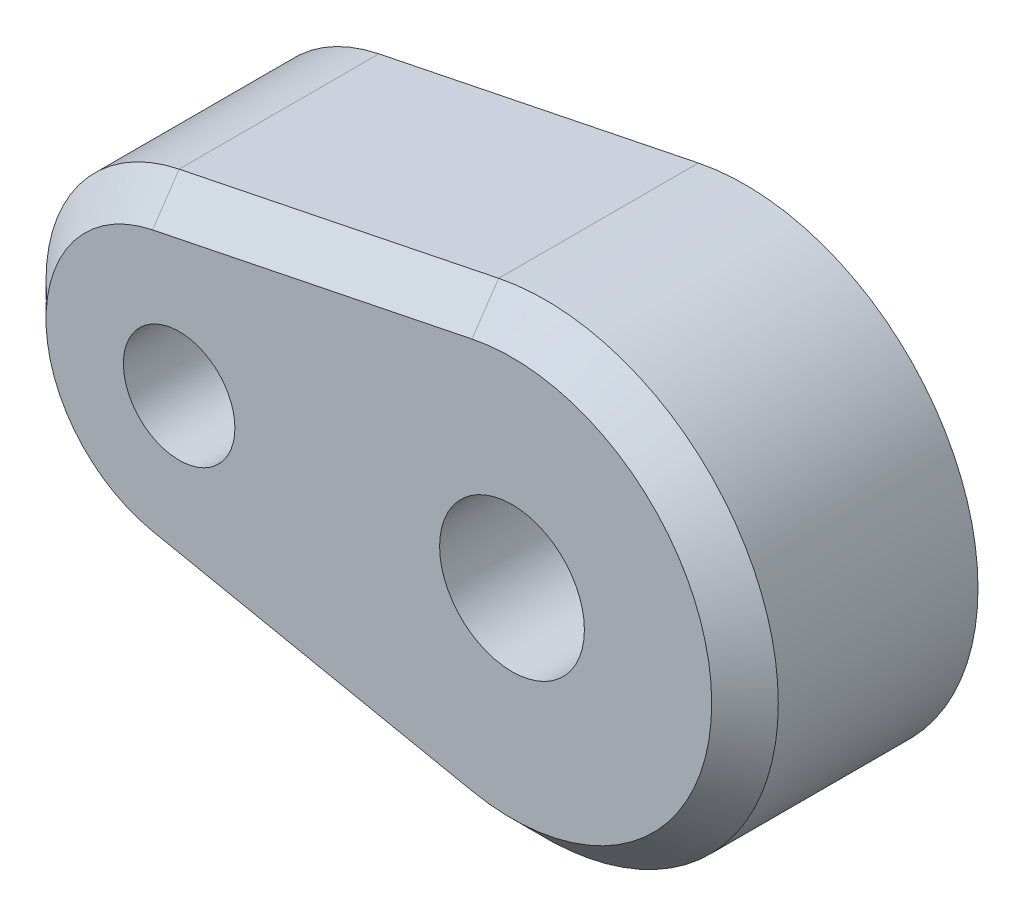
ISO-10303-21;
HEADER;
FILE_DESCRIPTION(('STEP AP214'),'2;1');
FILE_NAME('part.step','',(''),(''),'','','');
FILE_SCHEMA(('AUTOMOTIVE_DESIGN { 1 0 10303 214 1 1 1 1 }'));
ENDSEC;
DATA;
#1=APPLICATION_CONTEXT('core data for automotive mechanical design processes');
#2=APPLICATION_PROTOCOL_DEFINITION('international standard','automotive_design',2000,#1);
#3=PRODUCT_CONTEXT('',#1,'mechanical');
#4=PRODUCT('Part','Part','',(#3));
#5=PRODUCT_RELATED_PRODUCT_CATEGORY('part','',(#4));
#6=PRODUCT_DEFINITION_FORMATION('','',#4);
#7=PRODUCT_DEFINITION_CONTEXT('part definition',#1,'design');
#8=PRODUCT_DEFINITION('design','',#6,#7);
#9=PRODUCT_DEFINITION_SHAPE('','',#8);
#10=(LENGTH_UNIT() NAMED_UNIT(*) SI_UNIT(.MILLI.,.METRE.));
#11=(NAMED_UNIT(*) PLANE_ANGLE_UNIT() SI_UNIT($,.RADIAN.));
#12=(NAMED_UNIT(*) SI_UNIT($,.STERADIAN.) SOLID_ANGLE_UNIT());
#13=UNCERTAINTY_MEASURE_WITH_UNIT(LENGTH_MEASURE(1.E-05),#10,'distance_accuracy_value','');
#14=(GEOMETRIC_REPRESENTATION_CONTEXT(3) GLOBAL_UNCERTAINTY_ASSIGNED_CONTEXT((#13)) GLOBAL_UNIT_ASSIGNED_CONTEXT((#10,
#11,#12)) REPRESENTATION_CONTEXT('',''));
#15=CARTESIAN_POINT('',(0.,0.,0.));
#16=DIRECTION('',(0.,0.,1.));
#17=DIRECTION('',(1.,0.,0.));
#18=AXIS2_PLACEMENT_3D('',#15,#16,#17);
#19=CARTESIAN_POINT('',(0.,0.,7.));
#20=DIRECTION('',(0.,0.,-1.));
#21=DIRECTION('',(-1.,0.,0.));
#22=AXIS2_PLACEMENT_3D('',#19,#20,#21);
#23=CYLINDRICAL_SURFACE('',#22,2.175);
#24=CARTESIAN_POINT('',(0.,0.,7.));
#25=DIRECTION('',(0.,0.,1.));
#26=DIRECTION('',(1.,0.,0.));
#27=AXIS2_PLACEMENT_3D('',#24,#25,#26);
#28=CIRCLE('',#27,2.175);
#29=CARTESIAN_POINT('',(2.175,0.,7.));
#30=VERTEX_POINT('',#29);
#31=EDGE_CURVE('E105',#30,#30,#28,.T.);
#32=ORIENTED_EDGE('',*,*,#31,.T.);
#33=EDGE_LOOP('',(#32));
#34=FACE_BOUND('',#33,.T.);
#35=CARTESIAN_POINT('',(0.,0.,3.4));
#36=DIRECTION('',(0.,0.,-1.));
#37=DIRECTION('',(-1.,0.,0.));
#38=AXIS2_PLACEMENT_3D('',#35,#36,#37);
#39=CIRCLE('',#38,2.175);
#40=CARTESIAN_POINT('',(-2.175,0.,3.4));
#41=VERTEX_POINT('',#40);
#42=EDGE_CURVE('E119',#41,#41,#39,.T.);
#43=ORIENTED_EDGE('',*,*,#42,.T.);
#44=EDGE_LOOP('',(#43));
#45=FACE_BOUND('',#44,.T.);
#46=ADVANCED_FACE('F33',(#34,#45),#23,.F.);
#47=CARTESIAN_POINT('',(0.,0.,7.));
#48=DIRECTION('',(0.,0.,1.));
#49=DIRECTION('',(1.,0.,0.));
#50=AXIS2_PLACEMENT_3D('',#47,#48,#49);
#51=PLANE('',#50);
#52=DIRECTION('',(-0.979795897113271,-0.2,0.));
#53=VECTOR('',#52,1.);
#54=CARTESIAN_POINT('',(-10.8,3.91918358845308,7.));
#55=LINE('',#54,#53);
#56=CARTESIAN_POINT('',(-1.2,5.87877538267962,7.));
#57=VERTEX_POINT('',#56);
#58=CARTESIAN_POINT('',(-10.8,3.91918358845308,7.));
#59=VERTEX_POINT('',#58);
#60=EDGE_CURVE('E124',#57,#59,#55,.T.);
#61=ORIENTED_EDGE('',*,*,#60,.T.);
#62=CARTESIAN_POINT('',(-10.,0.,7.));
#63=DIRECTION('',(0.,0.,1.));
#64=DIRECTION('',(1.,0.,0.));
#65=AXIS2_PLACEMENT_3D('',#62,#63,#64);
#66=CIRCLE('',#65,4.);
#67=CARTESIAN_POINT('',(-10.8,-3.91918358845308,7.));
#68=VERTEX_POINT('',#67);
#69=EDGE_CURVE('E128',#59,#68,#66,.T.);
#70=ORIENTED_EDGE('',*,*,#69,.T.);
#71=DIRECTION('',(0.979795897113271,-0.2,0.));
#72=VECTOR('',#71,1.);
#73=CARTESIAN_POINT('',(-1.2,-5.87877538267962,7.));
#74=LINE('',#73,#72);
#75=CARTESIAN_POINT('',(-1.2,-5.87877538267962,7.));
#76=VERTEX_POINT('',#75);
#77=EDGE_CURVE('E126',#68,#76,#74,.T.);
#78=ORIENTED_EDGE('',*,*,#77,.T.);
#79=CARTESIAN_POINT('',(0.,0.,7.));
#80=DIRECTION('',(0.,0.,1.));
#81=DIRECTION('',(1.,0.,0.));
#82=AXIS2_PLACEMENT_3D('',#79,#80,#81);
#83=CIRCLE('',#82,5.99999999999999);
#84=EDGE_CURVE('E91',#76,#57,#83,.T.);
#85=ORIENTED_EDGE('',*,*,#84,.T.);
#86=EDGE_LOOP('',(#61,#70,#78,#85));
#87=FACE_BOUND('',#86,.T.);
#88=ORIENTED_EDGE('',*,*,#31,.F.);
#89=EDGE_LOOP('',(#88));
#90=FACE_BOUND('',#89,.T.);
#91=CARTESIAN_POINT('',(-10.,0.,7.));
#92=DIRECTION('',(0.,0.,1.));
#93=DIRECTION('',(1.,0.,0.));
#94=AXIS2_PLACEMENT_3D('',#91,#92,#93);
#95=CIRCLE('',#94,1.675);
#96=CARTESIAN_POINT('',(-8.325,0.,7.));
#97=VERTEX_POINT('',#96);
#98=EDGE_CURVE('E108',#97,#97,#95,.T.);
#99=ORIENTED_EDGE('',*,*,#98,.F.);
#100=EDGE_LOOP('',(#99));
#101=FACE_BOUND('',#100,.T.);
#102=ADVANCED_FACE('F167',(#87,#90,#101),#51,.T.);
#103=CARTESIAN_POINT('',(0.,0.,0.));
#104=DIRECTION('',(0.,0.,1.));
#105=DIRECTION('',(1.,0.,0.));
#106=AXIS2_PLACEMENT_3D('',#103,#104,#105);
#107=PLANE('',#106);
#108=CARTESIAN_POINT('',(-10.,0.,0.));
#109=DIRECTION('',(0.,0.,1.));
#110=DIRECTION('',(1.,0.,0.));
#111=AXIS2_PLACEMENT_3D('',#108,#109,#110);
#112=CIRCLE('',#111,2.175);
#113=CARTESIAN_POINT('',(-7.825,0.,0.));
#114=VERTEX_POINT('',#113);
#115=EDGE_CURVE('E151',#114,#114,#112,.T.);
#116=ORIENTED_EDGE('',*,*,#115,.T.);
#117=EDGE_LOOP('',(#116));
#118=FACE_BOUND('',#117,.T.);
#119=CARTESIAN_POINT('',(0.,0.,0.));
#120=DIRECTION('',(0.,0.,1.));
#121=DIRECTION('',(1.,0.,0.));
#122=AXIS2_PLACEMENT_3D('',#119,#120,#121);
#123=CIRCLE('',#122,4.85000000000001);
#124=CARTESIAN_POINT('',(4.85000000000001,0.,0.));
#125=VERTEX_POINT('',#124);
#126=EDGE_CURVE('E138',#125,#125,#123,.T.);
#127=ORIENTED_EDGE('',*,*,#126,.T.);
#128=EDGE_LOOP('',(#127));
#129=FACE_BOUND('',#128,.T.);
#130=CARTESIAN_POINT('',(0.,0.,0.));
#131=DIRECTION('',(0.,0.,1.));
#132=DIRECTION('',(1.,0.,0.));
#133=AXIS2_PLACEMENT_3D('',#130,#131,#132);
#134=CIRCLE('',#133,7.);
#135=CARTESIAN_POINT('',(-1.4,-6.8585712797929,0.));
#136=VERTEX_POINT('',#135);
#137=CARTESIAN_POINT('',(-1.4,6.8585712797929,0.));
#138=VERTEX_POINT('',#137);
#139=EDGE_CURVE('E98',#136,#138,#134,.T.);
#140=ORIENTED_EDGE('',*,*,#139,.F.);
#141=DIRECTION('',(0.979795897113271,-0.2,0.));
#142=VECTOR('',#141,1.);
#143=CARTESIAN_POINT('',(-11.,-4.89897948556636,0.));
#144=LINE('',#143,#142);
#145=CARTESIAN_POINT('',(-11.,-4.89897948556636,0.));
#146=VERTEX_POINT('',#145);
#147=EDGE_CURVE('E113',#146,#136,#144,.T.);
#148=ORIENTED_EDGE('',*,*,#147,.F.);
#149=CARTESIAN_POINT('',(-10.,0.,0.));
#150=DIRECTION('',(0.,0.,1.));
#151=DIRECTION('',(1.,0.,0.));
#152=AXIS2_PLACEMENT_3D('',#149,#150,#151);
#153=CIRCLE('',#152,5.);
#154=CARTESIAN_POINT('',(-11.,4.89897948556635,0.));
#155=VERTEX_POINT('',#154);
#156=EDGE_CURVE('E100',#155,#146,#153,.T.);
#157=ORIENTED_EDGE('',*,*,#156,.F.);
#158=DIRECTION('',(-0.979795897113271,-0.2,0.));
#159=VECTOR('',#158,1.);
#160=CARTESIAN_POINT('',(-1.4,6.8585712797929,0.));
#161=LINE('',#160,#159);
#162=EDGE_CURVE('E88',#138,#155,#161,.T.);
#163=ORIENTED_EDGE('',*,*,#162,.F.);
#164=EDGE_LOOP('',(#140,#148,#157,#163));
#165=FACE_BOUND('',#164,.T.);
#166=ADVANCED_FACE('F96',(#118,#129,#165),#107,.F.);
#167=CARTESIAN_POINT('',(0.,0.,7.));
#168=DIRECTION('',(0.,0.,-1.));
#169=DIRECTION('',(-1.,0.,0.));
#170=AXIS2_PLACEMENT_3D('',#167,#168,#169);
#171=CYLINDRICAL_SURFACE('',#170,7.);
#172=DIRECTION('',(0.,0.,-1.));
#173=VECTOR('',#172,1.);
#174=CARTESIAN_POINT('',(-1.4,6.8585712797929,7.));
#175=LINE('',#174,#173);
#176=CARTESIAN_POINT('',(-1.4,6.8585712797929,5.99999999999999));
#177=VERTEX_POINT('',#176);
#178=EDGE_CURVE('E85',#177,#138,#175,.T.);
#179=ORIENTED_EDGE('',*,*,#178,.F.);
#180=CARTESIAN_POINT('',(0.,0.,5.99999999999999));
#181=DIRECTION('',(0.,0.,1.));
#182=DIRECTION('',(1.,0.,0.));
#183=AXIS2_PLACEMENT_3D('',#180,#181,#182);
#184=CIRCLE('',#183,7.);
#185=CARTESIAN_POINT('',(-1.4,-6.8585712797929,5.99999999999999));
#186=VERTEX_POINT('',#185);
#187=EDGE_CURVE('E55',#177,#186,#184,.F.);
#188=ORIENTED_EDGE('',*,*,#187,.T.);
#189=DIRECTION('',(0.,0.,-1.));
#190=VECTOR('',#189,1.);
#191=CARTESIAN_POINT('',(-1.4,-6.8585712797929,7.));
#192=LINE('',#191,#190);
#193=EDGE_CURVE('E103',#186,#136,#192,.T.);
#194=ORIENTED_EDGE('',*,*,#193,.T.);
#195=ORIENTED_EDGE('',*,*,#139,.T.);
#196=EDGE_LOOP('',(#179,#188,#194,#195));
#197=FACE_BOUND('',#196,.T.);
#198=ADVANCED_FACE('F102',(#197),#171,.T.);
#199=CARTESIAN_POINT('',(-1.4,6.8585712797929,7.));
#200=DIRECTION('',(0.2,-0.979795897113271,0.));
#201=DIRECTION('',(0.979795897113271,0.2,0.));
#202=AXIS2_PLACEMENT_3D('',#199,#200,#201);
#203=PLANE('',#202);
#204=DIRECTION('',(0.,0.,-1.));
#205=VECTOR('',#204,1.);
#206=CARTESIAN_POINT('',(-11.,4.89897948556635,7.));
#207=LINE('',#206,#205);
#208=CARTESIAN_POINT('',(-11.,4.89897948556635,5.99999999999999));
#209=VERTEX_POINT('',#208);
#210=EDGE_CURVE('E92',#209,#155,#207,.T.);
#211=ORIENTED_EDGE('',*,*,#210,.F.);
#212=DIRECTION('',(0.979795897113271,0.2,0.));
#213=VECTOR('',#212,1.);
#214=CARTESIAN_POINT('',(-1.4,6.8585712797929,5.99999999999999));
#215=LINE('',#214,#213);
#216=EDGE_CURVE('E48',#209,#177,#215,.T.);
#217=ORIENTED_EDGE('',*,*,#216,.T.);
#218=ORIENTED_EDGE('',*,*,#178,.T.);
#219=ORIENTED_EDGE('',*,*,#162,.T.);
#220=EDGE_LOOP('',(#211,#217,#218,#219));
#221=FACE_BOUND('',#220,.T.);
#222=ADVANCED_FACE('F87',(#221),#203,.F.);
#223=CARTESIAN_POINT('',(-10.,0.,7.));
#224=DIRECTION('',(0.,0.,-1.));
#225=DIRECTION('',(-1.,0.,0.));
#226=AXIS2_PLACEMENT_3D('',#223,#224,#225);
#227=CYLINDRICAL_SURFACE('',#226,5.);
#228=DIRECTION('',(0.,0.,-1.));
#229=VECTOR('',#228,1.);
#230=CARTESIAN_POINT('',(-11.,-4.89897948556636,7.));
#231=LINE('',#230,#229);
#232=CARTESIAN_POINT('',(-11.,-4.89897948556636,5.99999999999999));
#233=VERTEX_POINT('',#232);
#234=EDGE_CURVE('E116',#233,#146,#231,.T.);
#235=ORIENTED_EDGE('',*,*,#234,.F.);
#236=CARTESIAN_POINT('',(-10.,0.,5.99999999999999));
#237=DIRECTION('',(0.,0.,1.));
#238=DIRECTION('',(1.,0.,0.));
#239=AXIS2_PLACEMENT_3D('',#236,#237,#238);
#240=CIRCLE('',#239,5.);
#241=EDGE_CURVE('E131',#233,#209,#240,.F.);
#242=ORIENTED_EDGE('',*,*,#241,.T.);
#243=ORIENTED_EDGE('',*,*,#210,.T.);
#244=ORIENTED_EDGE('',*,*,#156,.T.);
#245=EDGE_LOOP('',(#235,#242,#243,#244));
#246=FACE_BOUND('',#245,.T.);
#247=ADVANCED_FACE('F201',(#246),#227,.T.);
#248=CARTESIAN_POINT('',(-11.,-4.89897948556636,7.));
#249=DIRECTION('',(0.2,0.979795897113271,0.));
#250=DIRECTION('',(-0.979795897113271,0.2,0.));
#251=AXIS2_PLACEMENT_3D('',#248,#249,#250);
#252=PLANE('',#251);
#253=ORIENTED_EDGE('',*,*,#193,.F.);
#254=DIRECTION('',(-0.979795897113271,0.2,0.));
#255=VECTOR('',#254,1.);
#256=CARTESIAN_POINT('',(-11.,-4.89897948556636,5.99999999999999));
#257=LINE('',#256,#255);
#258=EDGE_CURVE('E134',#186,#233,#257,.T.);
#259=ORIENTED_EDGE('',*,*,#258,.T.);
#260=ORIENTED_EDGE('',*,*,#234,.T.);
#261=ORIENTED_EDGE('',*,*,#147,.T.);
#262=EDGE_LOOP('',(#253,#259,#260,#261));
#263=FACE_BOUND('',#262,.T.);
#264=ADVANCED_FACE('F198',(#263),#252,.F.);
#265=CARTESIAN_POINT('',(-10.,0.,7.));
#266=DIRECTION('',(0.,0.,-1.));
#267=DIRECTION('',(-1.,0.,0.));
#268=AXIS2_PLACEMENT_3D('',#265,#266,#267);
#269=CYLINDRICAL_SURFACE('',#268,1.675);
#270=CARTESIAN_POINT('',(-10.,0.,0.500000000000001));
#271=DIRECTION('',(0.,0.,1.));
#272=DIRECTION('',(1.,0.,0.));
#273=AXIS2_PLACEMENT_3D('',#270,#271,#272);
#274=CIRCLE('',#273,1.675);
#275=CARTESIAN_POINT('',(-8.325,0.,0.500000000000001));
#276=VERTEX_POINT('',#275);
#277=EDGE_CURVE('E41',#276,#276,#274,.F.);
#278=ORIENTED_EDGE('',*,*,#277,.T.);
#279=EDGE_LOOP('',(#278));
#280=FACE_BOUND('',#279,.T.);
#281=ORIENTED_EDGE('',*,*,#98,.T.);
#282=EDGE_LOOP('',(#281));
#283=FACE_BOUND('',#282,.T.);
#284=ADVANCED_FACE('F156',(#280,#283),#269,.F.);
#285=CARTESIAN_POINT('',(0.,0.,3.4));
#286=DIRECTION('',(0.,0.,-1.));
#287=DIRECTION('',(-1.,0.,0.));
#288=AXIS2_PLACEMENT_3D('',#285,#286,#287);
#289=CYLINDRICAL_SURFACE('',#288,4.35);
#290=CARTESIAN_POINT('',(0.,0.,0.500000000000005));
#291=DIRECTION('',(0.,0.,1.));
#292=DIRECTION('',(1.,0.,0.));
#293=AXIS2_PLACEMENT_3D('',#290,#291,#292);
#294=CIRCLE('',#293,4.35);
#295=CARTESIAN_POINT('',(4.35,0.,0.500000000000005));
#296=VERTEX_POINT('',#295);
#297=EDGE_CURVE('E11',#296,#296,#294,.F.);
#298=ORIENTED_EDGE('',*,*,#297,.T.);
#299=EDGE_LOOP('',(#298));
#300=FACE_BOUND('',#299,.T.);
#301=CARTESIAN_POINT('',(0.,0.,3.4));
#302=DIRECTION('',(0.,0.,-1.));
#303=DIRECTION('',(-1.,0.,0.));
#304=AXIS2_PLACEMENT_3D('',#301,#302,#303);
#305=CIRCLE('',#304,4.35);
#306=CARTESIAN_POINT('',(-4.35,0.,3.4));
#307=VERTEX_POINT('',#306);
#308=EDGE_CURVE('E122',#307,#307,#305,.T.);
#309=ORIENTED_EDGE('',*,*,#308,.F.);
#310=EDGE_LOOP('',(#309));
#311=FACE_BOUND('',#310,.T.);
#312=ADVANCED_FACE('F175',(#300,#311),#289,.F.);
#313=CARTESIAN_POINT('',(0.,0.,3.4));
#314=DIRECTION('',(0.,0.,-1.));
#315=DIRECTION('',(-1.,0.,0.));
#316=AXIS2_PLACEMENT_3D('',#313,#314,#315);
#317=PLANE('',#316);
#318=ORIENTED_EDGE('',*,*,#42,.F.);
#319=EDGE_LOOP('',(#318));
#320=FACE_BOUND('',#319,.T.);
#321=ORIENTED_EDGE('',*,*,#308,.T.);
#322=EDGE_LOOP('',(#321));
#323=FACE_BOUND('',#322,.T.);
#324=ADVANCED_FACE('F178',(#320,#323),#317,.T.);
#325=CARTESIAN_POINT('',(0.,0.,7.));
#326=DIRECTION('',(0.,0.,-1.));
#327=DIRECTION('',(-1.,0.,0.));
#328=AXIS2_PLACEMENT_3D('',#325,#326,#327);
#329=CONICAL_SURFACE('',#328,5.99999999999999,0.785398163397447);
#330=DIRECTION('',(0.141421356237309,0.69282032302755,0.707106781186549));
#331=VECTOR('',#330,1.);
#332=CARTESIAN_POINT('',(-1.4,-6.8585712797929,5.99999999999999));
#333=LINE('',#332,#331);
#334=EDGE_CURVE('E143',#186,#76,#333,.T.);
#335=ORIENTED_EDGE('',*,*,#334,.F.);
#336=ORIENTED_EDGE('',*,*,#187,.F.);
#337=DIRECTION('',(-0.141421356237309,0.69282032302755,-0.707106781186549));
#338=VECTOR('',#337,1.);
#339=CARTESIAN_POINT('',(-1.2,5.87877538267962,7.));
#340=LINE('',#339,#338);
#341=EDGE_CURVE('E146',#57,#177,#340,.T.);
#342=ORIENTED_EDGE('',*,*,#341,.F.);
#343=ORIENTED_EDGE('',*,*,#84,.F.);
#344=EDGE_LOOP('',(#335,#336,#342,#343));
#345=FACE_BOUND('',#344,.T.);
#346=ADVANCED_FACE('F220',(#345),#329,.T.);
#347=CARTESIAN_POINT('',(-1.2,5.87877538267962,7.));
#348=DIRECTION('',(-0.14142135623731,0.692820323027552,0.707106781186546));
#349=DIRECTION('',(0.979795897113271,0.2,0.));
#350=AXIS2_PLACEMENT_3D('',#347,#348,#349);
#351=PLANE('',#350);
#352=ORIENTED_EDGE('',*,*,#341,.T.);
#353=ORIENTED_EDGE('',*,*,#216,.F.);
#354=DIRECTION('',(-0.141421356237309,0.69282032302755,-0.707106781186549));
#355=VECTOR('',#354,1.);
#356=CARTESIAN_POINT('',(-10.8,3.91918358845308,7.));
#357=LINE('',#356,#355);
#358=EDGE_CURVE('E141',#59,#209,#357,.T.);
#359=ORIENTED_EDGE('',*,*,#358,.F.);
#360=ORIENTED_EDGE('',*,*,#60,.F.);
#361=EDGE_LOOP('',(#352,#353,#359,#360));
#362=FACE_BOUND('',#361,.T.);
#363=ADVANCED_FACE('F216',(#362),#351,.T.);
#364=CARTESIAN_POINT('',(-1.2,-5.87877538267962,7.));
#365=DIRECTION('',(-0.141421356237309,-0.692820323027552,0.707106781186546));
#366=DIRECTION('',(-0.979795897113271,0.2,0.));
#367=AXIS2_PLACEMENT_3D('',#364,#365,#366);
#368=PLANE('',#367);
#369=ORIENTED_EDGE('',*,*,#334,.T.);
#370=ORIENTED_EDGE('',*,*,#77,.F.);
#371=DIRECTION('',(0.141421356237309,0.69282032302755,0.707106781186549));
#372=VECTOR('',#371,1.);
#373=CARTESIAN_POINT('',(-11.,-4.89897948556636,5.99999999999999));
#374=LINE('',#373,#372);
#375=EDGE_CURVE('E139',#233,#68,#374,.T.);
#376=ORIENTED_EDGE('',*,*,#375,.F.);
#377=ORIENTED_EDGE('',*,*,#258,.F.);
#378=EDGE_LOOP('',(#369,#370,#376,#377));
#379=FACE_BOUND('',#378,.T.);
#380=ADVANCED_FACE('F212',(#379),#368,.T.);
#381=CARTESIAN_POINT('',(-10.,0.,7.));
#382=DIRECTION('',(0.,0.,-1.));
#383=DIRECTION('',(-1.,0.,0.));
#384=AXIS2_PLACEMENT_3D('',#381,#382,#383);
#385=CONICAL_SURFACE('',#384,4.,0.785398163397447);
#386=ORIENTED_EDGE('',*,*,#358,.T.);
#387=ORIENTED_EDGE('',*,*,#241,.F.);
#388=ORIENTED_EDGE('',*,*,#375,.T.);
#389=ORIENTED_EDGE('',*,*,#69,.F.);
#390=EDGE_LOOP('',(#386,#387,#388,#389));
#391=FACE_BOUND('',#390,.T.);
#392=ADVANCED_FACE('F162',(#391),#385,.T.);
#393=CARTESIAN_POINT('',(-10.,0.,0.));
#394=DIRECTION('',(0.,0.,-1.));
#395=DIRECTION('',(-1.,0.,0.));
#396=AXIS2_PLACEMENT_3D('',#393,#394,#395);
#397=CONICAL_SURFACE('',#396,2.175,0.785398163397444);
#398=ORIENTED_EDGE('',*,*,#277,.F.);
#399=EDGE_LOOP('',(#398));
#400=FACE_BOUND('',#399,.T.);
#401=ORIENTED_EDGE('',*,*,#115,.F.);
#402=EDGE_LOOP('',(#401));
#403=FACE_BOUND('',#402,.T.);
#404=ADVANCED_FACE('F159',(#400,#403),#397,.F.);
#405=CARTESIAN_POINT('',(0.,0.,0.500000000000005));
#406=DIRECTION('',(0.,0.,-1.));
#407=DIRECTION('',(-1.,0.,0.));
#408=AXIS2_PLACEMENT_3D('',#405,#406,#407);
#409=CONICAL_SURFACE('',#408,4.35,0.785398163397451);
#410=ORIENTED_EDGE('',*,*,#126,.F.);
#411=EDGE_LOOP('',(#410));
#412=FACE_BOUND('',#411,.T.);
#413=ORIENTED_EDGE('',*,*,#297,.F.);
#414=EDGE_LOOP('',(#413));
#415=FACE_BOUND('',#414,.T.);
#416=ADVANCED_FACE('F35',(#412,#415),#409,.F.);
#417=CLOSED_SHELL('',(#46,#102,#166,#198,#222,#247,#264,#284,#312,#324,#346,#363,#380,#392,#404,#416));
#418=MANIFOLD_SOLID_BREP('B2',#417);
#419=ADVANCED_BREP_SHAPE_REPRESENTATION('',(#18,#418),#14);
#420=SHAPE_DEFINITION_REPRESENTATION(#9,#419);
ENDSEC;
END-ISO-10303-21;
